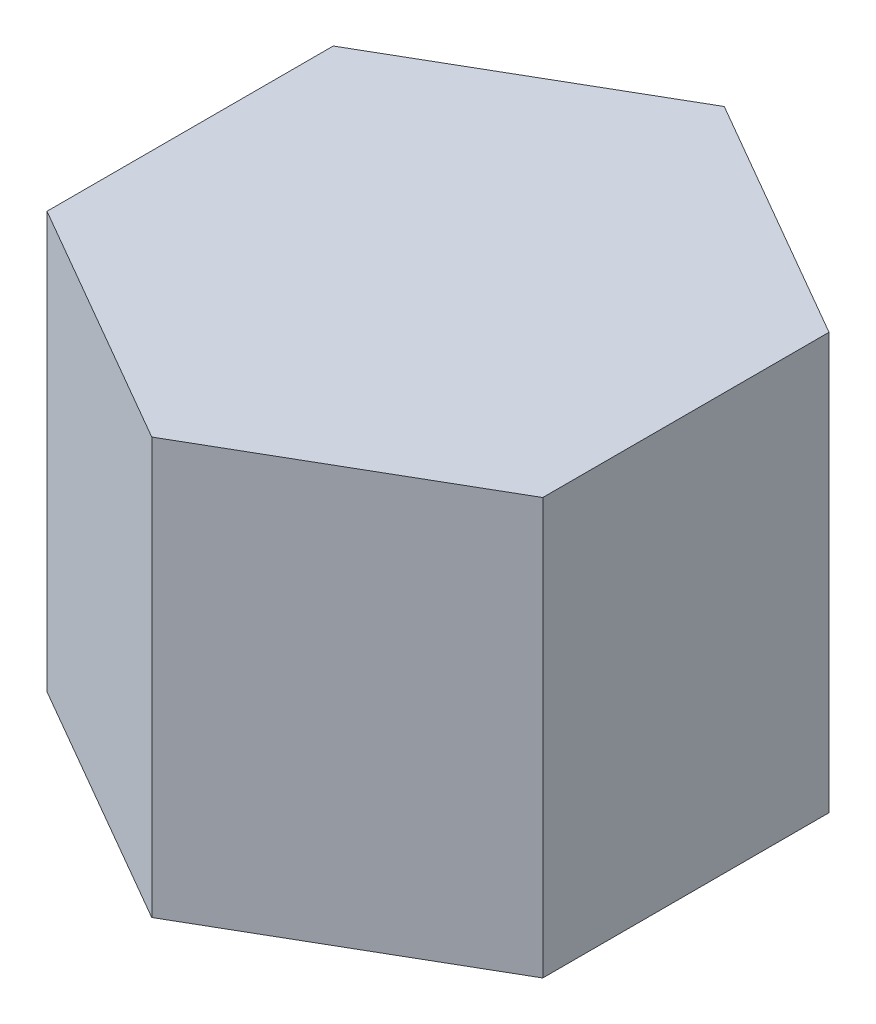
ISO-10303-21;
HEADER;
FILE_DESCRIPTION(('STEP AP214'),'2;1');
FILE_NAME('part.step','',(''),(''),'','','');
FILE_SCHEMA(('AUTOMOTIVE_DESIGN { 1 0 10303 214 1 1 1 1 }'));
ENDSEC;
DATA;
#1=APPLICATION_CONTEXT('core data for automotive mechanical design processes');
#2=APPLICATION_PROTOCOL_DEFINITION('international standard','automotive_design',2000,#1);
#3=PRODUCT_CONTEXT('',#1,'mechanical');
#4=PRODUCT('Part','Part','',(#3));
#5=PRODUCT_RELATED_PRODUCT_CATEGORY('part','',(#4));
#6=PRODUCT_DEFINITION_FORMATION('','',#4);
#7=PRODUCT_DEFINITION_CONTEXT('part definition',#1,'design');
#8=PRODUCT_DEFINITION('design','',#6,#7);
#9=PRODUCT_DEFINITION_SHAPE('','',#8);
#10=(LENGTH_UNIT() NAMED_UNIT(*) SI_UNIT(.MILLI.,.METRE.));
#11=(NAMED_UNIT(*) PLANE_ANGLE_UNIT() SI_UNIT($,.RADIAN.));
#12=(NAMED_UNIT(*) SI_UNIT($,.STERADIAN.) SOLID_ANGLE_UNIT());
#13=UNCERTAINTY_MEASURE_WITH_UNIT(LENGTH_MEASURE(1.E-05),#10,'distance_accuracy_value','');
#14=(GEOMETRIC_REPRESENTATION_CONTEXT(3) GLOBAL_UNCERTAINTY_ASSIGNED_CONTEXT((#13)) GLOBAL_UNIT_ASSIGNED_CONTEXT((#10,
#11,#12)) REPRESENTATION_CONTEXT('',''));
#15=CARTESIAN_POINT('',(0.,0.,0.));
#16=DIRECTION('',(0.,0.,1.));
#17=DIRECTION('',(1.,0.,0.));
#18=AXIS2_PLACEMENT_3D('',#15,#16,#17);
#19=CARTESIAN_POINT('',(203.839551417382,-147.556598747966,292.547996624279));
#20=DIRECTION('',(-0.500000000000096,0.,-0.866025403784383));
#21=DIRECTION('',(-0.866025403784383,0.,0.500000000000096));
#22=AXIS2_PLACEMENT_3D('',#19,#20,#21);
#23=PLANE('',#22);
#24=CARTESIAN_POINT('',(204.142660308706,-147.047793579175,292.372996624279));
#25=DIRECTION('',(-0.866025403784383,0.,0.500000000000096));
#26=VECTOR('',#25,1.);
#27=LINE('',#24,#26);
#28=CARTESIAN_POINT('',(204.142660308706,-147.047793579175,292.372996624279));
#29=VERTEX_POINT('',#28);
#30=CARTESIAN_POINT('',(203.839551417382,-147.047793579175,292.547996624279));
#31=VERTEX_POINT('',#30);
#32=EDGE_CURVE('E170',#29,#31,#27,.T.);
#33=ORIENTED_EDGE('',*,*,#32,.T.);
#34=CARTESIAN_POINT('',(203.839551417382,-147.556598747966,292.547996624279));
#35=DIRECTION('',(0.,1.,0.));
#36=VECTOR('',#35,1.);
#37=LINE('',#34,#36);
#38=CARTESIAN_POINT('',(203.839551417382,-147.556598747966,292.547996624279));
#39=VERTEX_POINT('',#38);
#40=EDGE_CURVE('E35',#39,#31,#37,.T.);
#41=ORIENTED_EDGE('',*,*,#40,.F.);
#42=CARTESIAN_POINT('',(204.142660308706,-147.556598747966,292.372996624279));
#43=DIRECTION('',(-0.866025403784383,0.,0.500000000000096));
#44=VECTOR('',#43,1.);
#45=LINE('',#42,#44);
#46=CARTESIAN_POINT('',(204.142660308706,-147.556598747966,292.372996624279));
#47=VERTEX_POINT('',#46);
#48=EDGE_CURVE('E159',#47,#39,#45,.T.);
#49=ORIENTED_EDGE('',*,*,#48,.F.);
#50=CARTESIAN_POINT('',(204.142660308706,-147.556598747966,292.372996624279));
#51=DIRECTION('',(0.,1.,0.));
#52=VECTOR('',#51,1.);
#53=LINE('',#50,#52);
#54=EDGE_CURVE('E10',#47,#29,#53,.T.);
#55=ORIENTED_EDGE('',*,*,#54,.T.);
#56=EDGE_LOOP('',(#33,#41,#49,#55));
#57=FACE_BOUND('',#56,.T.);
#58=ADVANCED_FACE('F16',(#57),#23,.F.);
#59=CARTESIAN_POINT('',(204.142660308706,-147.556598747966,291.594471220494));
#60=DIRECTION('',(-1.,0.,0.));
#61=DIRECTION('',(0.,-1.,0.));
#62=AXIS2_PLACEMENT_3D('',#59,#60,#61);
#63=PLANE('',#62);
#64=CARTESIAN_POINT('',(204.142660308706,-147.047793579175,292.022996624279));
#65=DIRECTION('',(0.,0.,1.));
#66=VECTOR('',#65,1.);
#67=LINE('',#64,#66);
#68=CARTESIAN_POINT('',(204.142660308706,-147.047793579175,292.022996624279));
#69=VERTEX_POINT('',#68);
#70=EDGE_CURVE('E167',#69,#29,#67,.T.);
#71=ORIENTED_EDGE('',*,*,#70,.T.);
#72=ORIENTED_EDGE('',*,*,#54,.F.);
#73=CARTESIAN_POINT('',(204.142660308706,-147.556598747966,292.022996624279));
#74=DIRECTION('',(0.,0.,1.));
#75=VECTOR('',#74,1.);
#76=LINE('',#73,#75);
#77=CARTESIAN_POINT('',(204.142660308706,-147.556598747966,292.022996624279));
#78=VERTEX_POINT('',#77);
#79=EDGE_CURVE('E156',#78,#47,#76,.T.);
#80=ORIENTED_EDGE('',*,*,#79,.F.);
#81=CARTESIAN_POINT('',(204.142660308706,-147.556598747966,292.022996624279));
#82=DIRECTION('',(0.,1.,0.));
#83=VECTOR('',#82,1.);
#84=LINE('',#81,#83);
#85=EDGE_CURVE('E27',#78,#69,#84,.T.);
#86=ORIENTED_EDGE('',*,*,#85,.T.);
#87=EDGE_LOOP('',(#71,#72,#80,#86));
#88=FACE_BOUND('',#87,.T.);
#89=ADVANCED_FACE('F189',(#88),#63,.F.);
#90=CARTESIAN_POINT('',(204.142660308706,-147.556598747966,292.022996624279));
#91=DIRECTION('',(-0.500000000000062,0.,0.866025403784403));
#92=DIRECTION('',(0.866025403784403,0.,0.500000000000062));
#93=AXIS2_PLACEMENT_3D('',#90,#91,#92);
#94=PLANE('',#93);
#95=CARTESIAN_POINT('',(203.839551417381,-147.047793579175,291.847996624279));
#96=DIRECTION('',(0.866025403784403,0.,0.500000000000062));
#97=VECTOR('',#96,1.);
#98=LINE('',#95,#97);
#99=CARTESIAN_POINT('',(203.839551417382,-147.047793579175,291.847996624279));
#100=VERTEX_POINT('',#99);
#101=EDGE_CURVE('E163',#100,#69,#98,.T.);
#102=ORIENTED_EDGE('',*,*,#101,.T.);
#103=ORIENTED_EDGE('',*,*,#85,.F.);
#104=CARTESIAN_POINT('',(203.839551417381,-147.556598747966,291.847996624279));
#105=DIRECTION('',(0.866025403784403,0.,0.500000000000062));
#106=VECTOR('',#105,1.);
#107=LINE('',#104,#106);
#108=CARTESIAN_POINT('',(203.839551417382,-147.556598747966,291.847996624279));
#109=VERTEX_POINT('',#108);
#110=EDGE_CURVE('E106',#109,#78,#107,.T.);
#111=ORIENTED_EDGE('',*,*,#110,.F.);
#112=CARTESIAN_POINT('',(203.839551417381,-147.556598747966,291.847996624279));
#113=DIRECTION('',(0.,1.,0.));
#114=VECTOR('',#113,1.);
#115=LINE('',#112,#114);
#116=EDGE_CURVE('E94',#109,#100,#115,.T.);
#117=ORIENTED_EDGE('',*,*,#116,.T.);
#118=EDGE_LOOP('',(#102,#103,#111,#117));
#119=FACE_BOUND('',#118,.T.);
#120=ADVANCED_FACE('F198',(#119),#94,.F.);
#121=CARTESIAN_POINT('',(203.839551417382,-147.556598747966,291.847996624279));
#122=DIRECTION('',(0.500000000000062,0.,0.866025403784403));
#123=DIRECTION('',(0.866025403784403,0.,-0.500000000000062));
#124=AXIS2_PLACEMENT_3D('',#121,#122,#123);
#125=PLANE('',#124);
#126=CARTESIAN_POINT('',(203.536442526057,-147.047793579175,292.022996624279));
#127=DIRECTION('',(0.866025403784403,0.,-0.500000000000062));
#128=VECTOR('',#127,1.);
#129=LINE('',#126,#128);
#130=CARTESIAN_POINT('',(203.536442526057,-147.047793579175,292.022996624279));
#131=VERTEX_POINT('',#130);
#132=EDGE_CURVE('E162',#131,#100,#129,.T.);
#133=ORIENTED_EDGE('',*,*,#132,.T.);
#134=ORIENTED_EDGE('',*,*,#116,.F.);
#135=CARTESIAN_POINT('',(203.536442526057,-147.556598747966,292.022996624279));
#136=DIRECTION('',(0.866025403784403,0.,-0.500000000000062));
#137=VECTOR('',#136,1.);
#138=LINE('',#135,#137);
#139=CARTESIAN_POINT('',(203.536442526057,-147.556598747966,292.022996624279));
#140=VERTEX_POINT('',#139);
#141=EDGE_CURVE('E98',#140,#109,#138,.T.);
#142=ORIENTED_EDGE('',*,*,#141,.F.);
#143=CARTESIAN_POINT('',(203.536442526057,-147.556598747966,292.022996624279));
#144=DIRECTION('',(0.,1.,0.));
#145=VECTOR('',#144,1.);
#146=LINE('',#143,#145);
#147=EDGE_CURVE('E79',#140,#131,#146,.T.);
#148=ORIENTED_EDGE('',*,*,#147,.T.);
#149=EDGE_LOOP('',(#133,#134,#142,#148));
#150=FACE_BOUND('',#149,.T.);
#151=ADVANCED_FACE('F100',(#150),#125,.F.);
#152=CARTESIAN_POINT('',(203.536442526057,-147.556598747966,291.594471220494));
#153=DIRECTION('',(1.,0.,0.));
#154=DIRECTION('',(0.,1.,0.));
#155=AXIS2_PLACEMENT_3D('',#152,#153,#154);
#156=PLANE('',#155);
#157=CARTESIAN_POINT('',(203.536442526057,-147.047793579175,292.372996624279));
#158=DIRECTION('',(0.,0.,-1.));
#159=VECTOR('',#158,1.);
#160=LINE('',#157,#159);
#161=CARTESIAN_POINT('',(203.536442526057,-147.047793579175,292.372996624279));
#162=VERTEX_POINT('',#161);
#163=EDGE_CURVE('E88',#162,#131,#160,.T.);
#164=ORIENTED_EDGE('',*,*,#163,.T.);
#165=ORIENTED_EDGE('',*,*,#147,.F.);
#166=CARTESIAN_POINT('',(203.536442526057,-147.556598747966,292.372996624279));
#167=DIRECTION('',(0.,0.,-1.));
#168=VECTOR('',#167,1.);
#169=LINE('',#166,#168);
#170=CARTESIAN_POINT('',(203.536442526057,-147.556598747966,292.372996624279));
#171=VERTEX_POINT('',#170);
#172=EDGE_CURVE('E84',#171,#140,#169,.T.);
#173=ORIENTED_EDGE('',*,*,#172,.F.);
#174=CARTESIAN_POINT('',(203.536442526057,-147.556598747966,292.372996624279));
#175=DIRECTION('',(0.,1.,0.));
#176=VECTOR('',#175,1.);
#177=LINE('',#174,#176);
#178=EDGE_CURVE('E58',#171,#162,#177,.T.);
#179=ORIENTED_EDGE('',*,*,#178,.T.);
#180=EDGE_LOOP('',(#164,#165,#173,#179));
#181=FACE_BOUND('',#180,.T.);
#182=ADVANCED_FACE('F82',(#181),#156,.F.);
#183=CARTESIAN_POINT('',(203.536442526057,-147.556598747966,292.372996624279));
#184=DIRECTION('',(0.500000000000062,0.,-0.866025403784403));
#185=DIRECTION('',(-0.866025403784403,0.,-0.500000000000062));
#186=AXIS2_PLACEMENT_3D('',#183,#184,#185);
#187=PLANE('',#186);
#188=CARTESIAN_POINT('',(203.839551417382,-147.047793579175,292.547996624279));
#189=DIRECTION('',(-0.866025403784403,0.,-0.500000000000062));
#190=VECTOR('',#189,1.);
#191=LINE('',#188,#190);
#192=EDGE_CURVE('E160',#31,#162,#191,.T.);
#193=ORIENTED_EDGE('',*,*,#192,.T.);
#194=ORIENTED_EDGE('',*,*,#178,.F.);
#195=CARTESIAN_POINT('',(203.839551417382,-147.556598747966,292.547996624279));
#196=DIRECTION('',(-0.866025403784403,0.,-0.500000000000062));
#197=VECTOR('',#196,1.);
#198=LINE('',#195,#197);
#199=EDGE_CURVE('E112',#39,#171,#198,.T.);
#200=ORIENTED_EDGE('',*,*,#199,.F.);
#201=ORIENTED_EDGE('',*,*,#40,.T.);
#202=EDGE_LOOP('',(#193,#194,#200,#201));
#203=FACE_BOUND('',#202,.T.);
#204=ADVANCED_FACE('F131',(#203),#187,.F.);
#205=CARTESIAN_POINT('',(206.491105863044,-147.556598747966,291.594471220494));
#206=DIRECTION('',(0.,1.,0.));
#207=DIRECTION('',(-1.,0.,0.));
#208=AXIS2_PLACEMENT_3D('',#205,#206,#207);
#209=PLANE('',#208);
#210=ORIENTED_EDGE('',*,*,#48,.T.);
#211=ORIENTED_EDGE('',*,*,#199,.T.);
#212=ORIENTED_EDGE('',*,*,#172,.T.);
#213=ORIENTED_EDGE('',*,*,#141,.T.);
#214=ORIENTED_EDGE('',*,*,#110,.T.);
#215=ORIENTED_EDGE('',*,*,#79,.T.);
#216=EDGE_LOOP('',(#210,#211,#212,#213,#214,#215));
#217=FACE_BOUND('',#216,.T.);
#218=ADVANCED_FACE('F111',(#217),#209,.F.);
#219=CARTESIAN_POINT('',(206.491105863044,-147.047793579175,291.594471220494));
#220=DIRECTION('',(0.,1.,0.));
#221=DIRECTION('',(-1.,0.,0.));
#222=AXIS2_PLACEMENT_3D('',#219,#220,#221);
#223=PLANE('',#222);
#224=ORIENTED_EDGE('',*,*,#32,.F.);
#225=ORIENTED_EDGE('',*,*,#70,.F.);
#226=ORIENTED_EDGE('',*,*,#101,.F.);
#227=ORIENTED_EDGE('',*,*,#132,.F.);
#228=ORIENTED_EDGE('',*,*,#163,.F.);
#229=ORIENTED_EDGE('',*,*,#192,.F.);
#230=EDGE_LOOP('',(#224,#225,#226,#227,#228,#229));
#231=FACE_BOUND('',#230,.T.);
#232=ADVANCED_FACE('F130',(#231),#223,.T.);
#233=CLOSED_SHELL('',(#58,#89,#120,#151,#182,#204,#218,#232));
#234=MANIFOLD_SOLID_BREP('B1',#233);
#235=ADVANCED_BREP_SHAPE_REPRESENTATION('',(#18,#234),#14);
#236=SHAPE_DEFINITION_REPRESENTATION(#9,#235);
ENDSEC;
END-ISO-10303-21;
